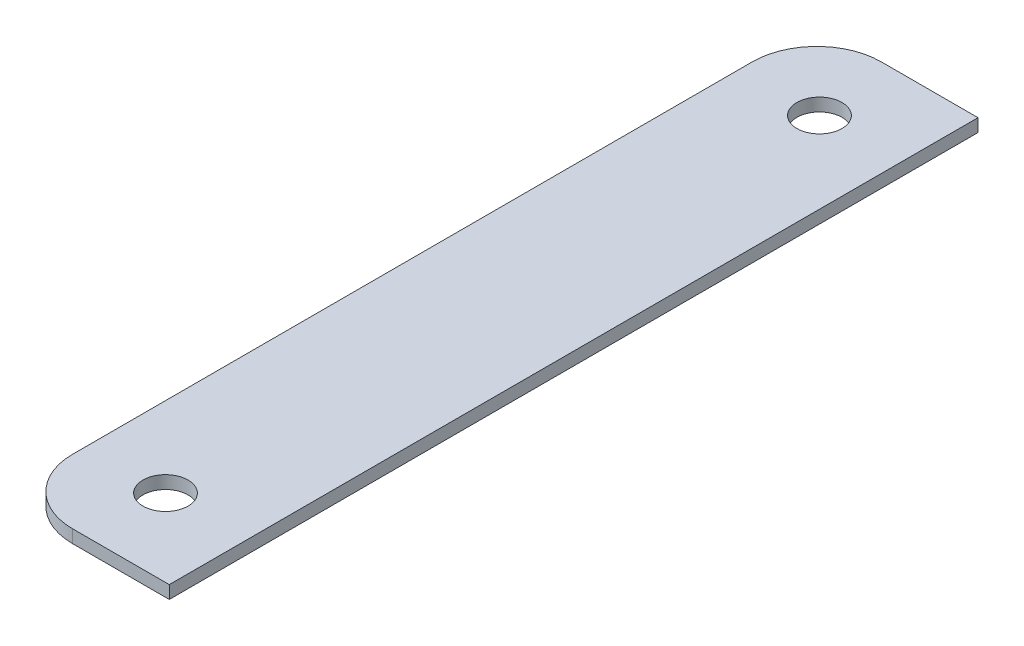
ISO-10303-21;
HEADER;
FILE_DESCRIPTION(('STEP AP214'),'2;1');
FILE_NAME('part.step','',(''),(''),'','','');
FILE_SCHEMA(('AUTOMOTIVE_DESIGN { 1 0 10303 214 1 1 1 1 }'));
ENDSEC;
DATA;
#1=APPLICATION_CONTEXT('core data for automotive mechanical design processes');
#2=APPLICATION_PROTOCOL_DEFINITION('international standard','automotive_design',2000,#1);
#3=PRODUCT_CONTEXT('',#1,'mechanical');
#4=PRODUCT('Part','Part','',(#3));
#5=PRODUCT_RELATED_PRODUCT_CATEGORY('part','',(#4));
#6=PRODUCT_DEFINITION_FORMATION('','',#4);
#7=PRODUCT_DEFINITION_CONTEXT('part definition',#1,'design');
#8=PRODUCT_DEFINITION('design','',#6,#7);
#9=PRODUCT_DEFINITION_SHAPE('','',#8);
#10=(LENGTH_UNIT() NAMED_UNIT(*) SI_UNIT(.MILLI.,.METRE.));
#11=(NAMED_UNIT(*) PLANE_ANGLE_UNIT() SI_UNIT($,.RADIAN.));
#12=(NAMED_UNIT(*) SI_UNIT($,.STERADIAN.) SOLID_ANGLE_UNIT());
#13=UNCERTAINTY_MEASURE_WITH_UNIT(LENGTH_MEASURE(1.E-05),#10,'distance_accuracy_value','');
#14=(GEOMETRIC_REPRESENTATION_CONTEXT(3) GLOBAL_UNCERTAINTY_ASSIGNED_CONTEXT((#13)) GLOBAL_UNIT_ASSIGNED_CONTEXT((#10,
#11,#12)) REPRESENTATION_CONTEXT('',''));
#15=CARTESIAN_POINT('',(0.,0.,0.));
#16=DIRECTION('',(0.,0.,1.));
#17=DIRECTION('',(1.,0.,0.));
#18=AXIS2_PLACEMENT_3D('',#15,#16,#17);
#19=CARTESIAN_POINT('',(0.,-4.,4.44089209850063E-13));
#20=DIRECTION('',(0.,1.,0.));
#21=DIRECTION('',(-1.,0.,0.));
#22=AXIS2_PLACEMENT_3D('',#19,#20,#21);
#23=PLANE('',#22);
#24=DIRECTION('',(0.,0.,-1.));
#25=VECTOR('',#24,1.);
#26=CARTESIAN_POINT('',(110.,-4.,197.705554788374));
#27=LINE('',#26,#25);
#28=CARTESIAN_POINT('',(109.999999999999,-4.00000000000003,187.705554788374));
#29=VERTEX_POINT('',#28);
#30=CARTESIAN_POINT('',(110.,-3.9999999999997,82.294445211627));
#31=VERTEX_POINT('',#30);
#32=EDGE_CURVE('E102',#29,#31,#27,.T.);
#33=ORIENTED_EDGE('',*,*,#32,.T.);
#34=CARTESIAN_POINT('',(120.,-3.99999999999989,82.2944452116271));
#35=DIRECTION('',(0.,1.,0.));
#36=DIRECTION('',(-1.,0.,0.));
#37=AXIS2_PLACEMENT_3D('',#34,#35,#36);
#38=CIRCLE('',#37,10.);
#39=CARTESIAN_POINT('',(120.,-3.9999999999997,72.2944452116271));
#40=VERTEX_POINT('',#39);
#41=EDGE_CURVE('E49',#31,#40,#38,.F.);
#42=ORIENTED_EDGE('',*,*,#41,.T.);
#43=DIRECTION('',(1.,0.,0.));
#44=VECTOR('',#43,1.);
#45=CARTESIAN_POINT('',(135.,-3.99999999999934,72.294445211628));
#46=LINE('',#45,#44);
#47=CARTESIAN_POINT('',(135.,-3.99999999999934,72.294445211628));
#48=VERTEX_POINT('',#47);
#49=EDGE_CURVE('E108',#40,#48,#46,.T.);
#50=ORIENTED_EDGE('',*,*,#49,.T.);
#51=DIRECTION('',(0.,0.,1.));
#52=VECTOR('',#51,1.);
#53=CARTESIAN_POINT('',(135.,-4.00000000000003,197.705554788374));
#54=LINE('',#53,#52);
#55=CARTESIAN_POINT('',(135.,-4.00000000000003,197.705554788374));
#56=VERTEX_POINT('',#55);
#57=EDGE_CURVE('E103',#48,#56,#54,.T.);
#58=ORIENTED_EDGE('',*,*,#57,.T.);
#59=DIRECTION('',(-1.,0.,0.));
#60=VECTOR('',#59,1.);
#61=CARTESIAN_POINT('',(135.,-4.00000000000003,197.705554788374));
#62=LINE('',#61,#60);
#63=CARTESIAN_POINT('',(120.,-3.99999999999999,197.705554788375));
#64=VERTEX_POINT('',#63);
#65=EDGE_CURVE('E93',#56,#64,#62,.T.);
#66=ORIENTED_EDGE('',*,*,#65,.T.);
#67=CARTESIAN_POINT('',(119.999999999999,-4.,187.705554788375));
#68=DIRECTION('',(0.,1.,0.));
#69=DIRECTION('',(-1.,0.,0.));
#70=AXIS2_PLACEMENT_3D('',#67,#68,#69);
#71=CIRCLE('',#70,10.);
#72=EDGE_CURVE('E142',#64,#29,#71,.F.);
#73=ORIENTED_EDGE('',*,*,#72,.T.);
#74=EDGE_LOOP('',(#33,#42,#50,#58,#66,#73));
#75=FACE_BOUND('',#74,.T.);
#76=CARTESIAN_POINT('',(122.414038057745,-3.99999999999978,185.705554788375));
#77=DIRECTION('',(0.,-1.,0.));
#78=DIRECTION('',(1.,0.,0.));
#79=AXIS2_PLACEMENT_3D('',#76,#77,#78);
#80=CIRCLE('',#79,3.50000000000001);
#81=CARTESIAN_POINT('',(125.914038057745,-3.99999999999978,185.705554788375));
#82=VERTEX_POINT('',#81);
#83=EDGE_CURVE('E171',#82,#82,#80,.T.);
#84=ORIENTED_EDGE('',*,*,#83,.F.);
#85=EDGE_LOOP('',(#84));
#86=FACE_BOUND('',#85,.T.);
#87=CARTESIAN_POINT('',(122.414038057745,-3.99999999999978,84.2944452116271));
#88=DIRECTION('',(0.,-1.,0.));
#89=DIRECTION('',(1.,0.,0.));
#90=AXIS2_PLACEMENT_3D('',#87,#88,#89);
#91=CIRCLE('',#90,3.49999999999998);
#92=CARTESIAN_POINT('',(125.914038057745,-3.99999999999978,84.2944452116271));
#93=VERTEX_POINT('',#92);
#94=EDGE_CURVE('E179',#93,#93,#91,.T.);
#95=ORIENTED_EDGE('',*,*,#94,.F.);
#96=EDGE_LOOP('',(#95));
#97=FACE_BOUND('',#96,.T.);
#98=ADVANCED_FACE('F40',(#75,#86,#97),#23,.F.);
#99=CARTESIAN_POINT('',(0.,-2.,6.66133814775094E-13));
#100=DIRECTION('',(0.,1.,0.));
#101=DIRECTION('',(-1.,0.,0.));
#102=AXIS2_PLACEMENT_3D('',#99,#100,#101);
#103=PLANE('',#102);
#104=CARTESIAN_POINT('',(122.414038057745,-1.99999999999978,185.705554788375));
#105=DIRECTION('',(0.,-1.,0.));
#106=DIRECTION('',(1.,0.,0.));
#107=AXIS2_PLACEMENT_3D('',#104,#105,#106);
#108=CIRCLE('',#107,3.50000000000001);
#109=CARTESIAN_POINT('',(125.914038057745,-1.99999999999978,185.705554788375));
#110=VERTEX_POINT('',#109);
#111=EDGE_CURVE('E175',#110,#110,#108,.T.);
#112=ORIENTED_EDGE('',*,*,#111,.T.);
#113=EDGE_LOOP('',(#112));
#114=FACE_BOUND('',#113,.T.);
#115=DIRECTION('',(1.,0.,0.));
#116=VECTOR('',#115,1.);
#117=CARTESIAN_POINT('',(135.,-1.99999999999934,72.2944452116283));
#118=LINE('',#117,#116);
#119=CARTESIAN_POINT('',(120.,-1.9999999999997,72.2944452116275));
#120=VERTEX_POINT('',#119);
#121=CARTESIAN_POINT('',(135.,-1.99999999999934,72.2944452116283));
#122=VERTEX_POINT('',#121);
#123=EDGE_CURVE('E113',#120,#122,#118,.T.);
#124=ORIENTED_EDGE('',*,*,#123,.F.);
#125=CARTESIAN_POINT('',(120.,-1.99999999999989,82.2944452116274));
#126=DIRECTION('',(0.,1.,0.));
#127=DIRECTION('',(-1.,0.,0.));
#128=AXIS2_PLACEMENT_3D('',#125,#126,#127);
#129=CIRCLE('',#128,10.);
#130=CARTESIAN_POINT('',(110.,-1.9999999999997,82.2944452116275));
#131=VERTEX_POINT('',#130);
#132=EDGE_CURVE('E133',#120,#131,#129,.T.);
#133=ORIENTED_EDGE('',*,*,#132,.T.);
#134=DIRECTION('',(0.,0.,-1.));
#135=VECTOR('',#134,1.);
#136=CARTESIAN_POINT('',(110.,-2.,197.705554788375));
#137=LINE('',#136,#135);
#138=CARTESIAN_POINT('',(109.999999999999,-2.00000000000003,187.705554788375));
#139=VERTEX_POINT('',#138);
#140=EDGE_CURVE('E159',#139,#131,#137,.T.);
#141=ORIENTED_EDGE('',*,*,#140,.F.);
#142=CARTESIAN_POINT('',(119.999999999999,-2.,187.705554788375));
#143=DIRECTION('',(0.,1.,0.));
#144=DIRECTION('',(-1.,0.,0.));
#145=AXIS2_PLACEMENT_3D('',#142,#143,#144);
#146=CIRCLE('',#145,10.);
#147=CARTESIAN_POINT('',(120.,-1.99999999999999,197.705554788375));
#148=VERTEX_POINT('',#147);
#149=EDGE_CURVE('E125',#139,#148,#146,.T.);
#150=ORIENTED_EDGE('',*,*,#149,.T.);
#151=DIRECTION('',(-1.,0.,0.));
#152=VECTOR('',#151,1.);
#153=CARTESIAN_POINT('',(135.,-2.00000000000003,197.705554788375));
#154=LINE('',#153,#152);
#155=CARTESIAN_POINT('',(135.,-2.00000000000003,197.705554788375));
#156=VERTEX_POINT('',#155);
#157=EDGE_CURVE('E163',#156,#148,#154,.T.);
#158=ORIENTED_EDGE('',*,*,#157,.F.);
#159=DIRECTION('',(0.,0.,1.));
#160=VECTOR('',#159,1.);
#161=CARTESIAN_POINT('',(135.,-2.00000000000003,197.705554788375));
#162=LINE('',#161,#160);
#163=EDGE_CURVE('E117',#122,#156,#162,.T.);
#164=ORIENTED_EDGE('',*,*,#163,.F.);
#165=EDGE_LOOP('',(#124,#133,#141,#150,#158,#164));
#166=FACE_BOUND('',#165,.T.);
#167=CARTESIAN_POINT('',(122.414038057745,-1.99999999999978,84.2944452116277));
#168=DIRECTION('',(0.,-1.,0.));
#169=DIRECTION('',(1.,0.,0.));
#170=AXIS2_PLACEMENT_3D('',#167,#168,#169);
#171=CIRCLE('',#170,3.49999999999998);
#172=CARTESIAN_POINT('',(125.914038057745,-1.99999999999978,84.2944452116277));
#173=VERTEX_POINT('',#172);
#174=EDGE_CURVE('E183',#173,#173,#171,.T.);
#175=ORIENTED_EDGE('',*,*,#174,.T.);
#176=EDGE_LOOP('',(#175));
#177=FACE_BOUND('',#176,.T.);
#178=ADVANCED_FACE('F157',(#114,#166,#177),#103,.T.);
#179=CARTESIAN_POINT('',(135.,-4.00000000000003,197.705554788374));
#180=DIRECTION('',(-1.,0.,0.));
#181=DIRECTION('',(0.,0.,1.));
#182=AXIS2_PLACEMENT_3D('',#179,#180,#181);
#183=PLANE('',#182);
#184=ORIENTED_EDGE('',*,*,#163,.T.);
#185=DIRECTION('',(0.,1.,0.));
#186=VECTOR('',#185,1.);
#187=CARTESIAN_POINT('',(135.,-4.00000000000003,197.705554788374));
#188=LINE('',#187,#186);
#189=EDGE_CURVE('E97',#56,#156,#188,.T.);
#190=ORIENTED_EDGE('',*,*,#189,.F.);
#191=ORIENTED_EDGE('',*,*,#57,.F.);
#192=DIRECTION('',(0.,1.,0.));
#193=VECTOR('',#192,1.);
#194=CARTESIAN_POINT('',(135.,-3.99999999999934,72.294445211628));
#195=LINE('',#194,#193);
#196=EDGE_CURVE('E120',#48,#122,#195,.T.);
#197=ORIENTED_EDGE('',*,*,#196,.T.);
#198=EDGE_LOOP('',(#184,#190,#191,#197));
#199=FACE_BOUND('',#198,.T.);
#200=ADVANCED_FACE('F115',(#199),#183,.F.);
#201=CARTESIAN_POINT('',(135.,-4.00000000000003,197.705554788374));
#202=DIRECTION('',(0.,0.,-1.));
#203=DIRECTION('',(0.,1.,0.));
#204=AXIS2_PLACEMENT_3D('',#201,#202,#203);
#205=PLANE('',#204);
#206=ORIENTED_EDGE('',*,*,#157,.T.);
#207=DIRECTION('',(0.,1.,0.));
#208=VECTOR('',#207,1.);
#209=CARTESIAN_POINT('',(120.,-3.99999999999999,197.705554788375));
#210=LINE('',#209,#208);
#211=EDGE_CURVE('E11',#148,#64,#210,.F.);
#212=ORIENTED_EDGE('',*,*,#211,.T.);
#213=ORIENTED_EDGE('',*,*,#65,.F.);
#214=ORIENTED_EDGE('',*,*,#189,.T.);
#215=EDGE_LOOP('',(#206,#212,#213,#214));
#216=FACE_BOUND('',#215,.T.);
#217=ADVANCED_FACE('F95',(#216),#205,.F.);
#218=CARTESIAN_POINT('',(110.,-4.,197.705554788374));
#219=DIRECTION('',(1.,0.,0.));
#220=DIRECTION('',(0.,0.,-1.));
#221=AXIS2_PLACEMENT_3D('',#218,#219,#220);
#222=PLANE('',#221);
#223=ORIENTED_EDGE('',*,*,#140,.T.);
#224=DIRECTION('',(0.,1.,0.));
#225=VECTOR('',#224,1.);
#226=CARTESIAN_POINT('',(110.,-3.9999999999997,82.294445211627));
#227=LINE('',#226,#225);
#228=EDGE_CURVE('E62',#131,#31,#227,.F.);
#229=ORIENTED_EDGE('',*,*,#228,.T.);
#230=ORIENTED_EDGE('',*,*,#32,.F.);
#231=DIRECTION('',(0.,1.,0.));
#232=VECTOR('',#231,1.);
#233=CARTESIAN_POINT('',(109.999999999999,-4.00000000000003,187.705554788374));
#234=LINE('',#233,#232);
#235=EDGE_CURVE('E136',#29,#139,#234,.T.);
#236=ORIENTED_EDGE('',*,*,#235,.T.);
#237=EDGE_LOOP('',(#223,#229,#230,#236));
#238=FACE_BOUND('',#237,.T.);
#239=ADVANCED_FACE('F160',(#238),#222,.F.);
#240=CARTESIAN_POINT('',(135.,-3.99999999999934,72.294445211628));
#241=DIRECTION('',(0.,0.,1.));
#242=DIRECTION('',(0.,-1.,0.));
#243=AXIS2_PLACEMENT_3D('',#240,#241,#242);
#244=PLANE('',#243);
#245=ORIENTED_EDGE('',*,*,#49,.F.);
#246=DIRECTION('',(0.,1.,0.));
#247=VECTOR('',#246,1.);
#248=CARTESIAN_POINT('',(120.,-3.9999999999997,72.2944452116271));
#249=LINE('',#248,#247);
#250=EDGE_CURVE('E119',#40,#120,#249,.T.);
#251=ORIENTED_EDGE('',*,*,#250,.T.);
#252=ORIENTED_EDGE('',*,*,#123,.T.);
#253=ORIENTED_EDGE('',*,*,#196,.F.);
#254=EDGE_LOOP('',(#245,#251,#252,#253));
#255=FACE_BOUND('',#254,.T.);
#256=ADVANCED_FACE('F151',(#255),#244,.F.);
#257=CARTESIAN_POINT('',(122.414038057745,-3.99999999999978,185.705554788375));
#258=DIRECTION('',(0.,1.,0.));
#259=DIRECTION('',(-1.,0.,0.));
#260=AXIS2_PLACEMENT_3D('',#257,#258,#259);
#261=CYLINDRICAL_SURFACE('',#260,3.50000000000001);
#262=ORIENTED_EDGE('',*,*,#83,.T.);
#263=EDGE_LOOP('',(#262));
#264=FACE_BOUND('',#263,.T.);
#265=ORIENTED_EDGE('',*,*,#111,.F.);
#266=EDGE_LOOP('',(#265));
#267=FACE_BOUND('',#266,.T.);
#268=ADVANCED_FACE('F203',(#264,#267),#261,.F.);
#269=CARTESIAN_POINT('',(122.414038057745,-3.99999999999978,84.2944452116271));
#270=DIRECTION('',(0.,1.,0.));
#271=DIRECTION('',(-1.,0.,0.));
#272=AXIS2_PLACEMENT_3D('',#269,#270,#271);
#273=CYLINDRICAL_SURFACE('',#272,3.49999999999998);
#274=ORIENTED_EDGE('',*,*,#94,.T.);
#275=EDGE_LOOP('',(#274));
#276=FACE_BOUND('',#275,.T.);
#277=ORIENTED_EDGE('',*,*,#174,.F.);
#278=EDGE_LOOP('',(#277));
#279=FACE_BOUND('',#278,.T.);
#280=ADVANCED_FACE('F192',(#276,#279),#273,.F.);
#281=CARTESIAN_POINT('',(120.,-3.99999999999989,82.2944452116271));
#282=DIRECTION('',(0.,1.,0.));
#283=DIRECTION('',(-1.,0.,0.));
#284=AXIS2_PLACEMENT_3D('',#281,#282,#283);
#285=CYLINDRICAL_SURFACE('',#284,10.);
#286=ORIENTED_EDGE('',*,*,#41,.F.);
#287=ORIENTED_EDGE('',*,*,#228,.F.);
#288=ORIENTED_EDGE('',*,*,#132,.F.);
#289=ORIENTED_EDGE('',*,*,#250,.F.);
#290=EDGE_LOOP('',(#286,#287,#288,#289));
#291=FACE_BOUND('',#290,.T.);
#292=ADVANCED_FACE('F154',(#291),#285,.T.);
#293=CARTESIAN_POINT('',(119.999999999999,-4.,187.705554788375));
#294=DIRECTION('',(0.,1.,0.));
#295=DIRECTION('',(-1.,0.,0.));
#296=AXIS2_PLACEMENT_3D('',#293,#294,#295);
#297=CYLINDRICAL_SURFACE('',#296,10.);
#298=ORIENTED_EDGE('',*,*,#72,.F.);
#299=ORIENTED_EDGE('',*,*,#211,.F.);
#300=ORIENTED_EDGE('',*,*,#149,.F.);
#301=ORIENTED_EDGE('',*,*,#235,.F.);
#302=EDGE_LOOP('',(#298,#299,#300,#301));
#303=FACE_BOUND('',#302,.T.);
#304=ADVANCED_FACE('F42',(#303),#297,.T.);
#305=CLOSED_SHELL('',(#98,#178,#200,#217,#239,#256,#268,#280,#292,#304));
#306=MANIFOLD_SOLID_BREP('B2',#305);
#307=ADVANCED_BREP_SHAPE_REPRESENTATION('',(#18,#306),#14);
#308=SHAPE_DEFINITION_REPRESENTATION(#9,#307);
ENDSEC;
END-ISO-10303-21;
